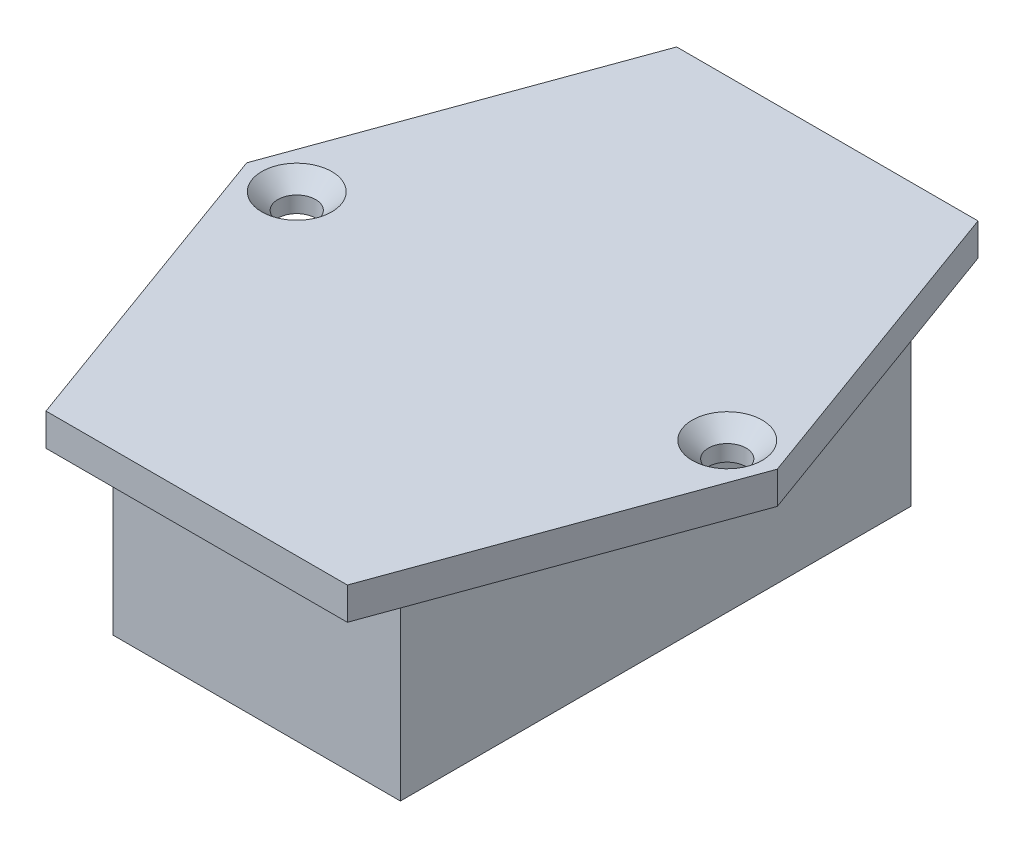
ISO-10303-21;
HEADER;
FILE_DESCRIPTION(('STEP AP214'),'2;1');
FILE_NAME('part.step','',(''),(''),'','','');
FILE_SCHEMA(('AUTOMOTIVE_DESIGN { 1 0 10303 214 1 1 1 1 }'));
ENDSEC;
DATA;
#1=APPLICATION_CONTEXT('core data for automotive mechanical design processes');
#2=APPLICATION_PROTOCOL_DEFINITION('international standard','automotive_design',2000,#1);
#3=PRODUCT_CONTEXT('',#1,'mechanical');
#4=PRODUCT('Part','Part','',(#3));
#5=PRODUCT_RELATED_PRODUCT_CATEGORY('part','',(#4));
#6=PRODUCT_DEFINITION_FORMATION('','',#4);
#7=PRODUCT_DEFINITION_CONTEXT('part definition',#1,'design');
#8=PRODUCT_DEFINITION('design','',#6,#7);
#9=PRODUCT_DEFINITION_SHAPE('','',#8);
#10=(LENGTH_UNIT() NAMED_UNIT(*) SI_UNIT(.MILLI.,.METRE.));
#11=(NAMED_UNIT(*) PLANE_ANGLE_UNIT() SI_UNIT($,.RADIAN.));
#12=(NAMED_UNIT(*) SI_UNIT($,.STERADIAN.) SOLID_ANGLE_UNIT());
#13=UNCERTAINTY_MEASURE_WITH_UNIT(LENGTH_MEASURE(1.E-05),#10,'distance_accuracy_value','');
#14=(GEOMETRIC_REPRESENTATION_CONTEXT(3) GLOBAL_UNCERTAINTY_ASSIGNED_CONTEXT((#13)) GLOBAL_UNIT_ASSIGNED_CONTEXT((#10,
#11,#12)) REPRESENTATION_CONTEXT('',''));
#15=CARTESIAN_POINT('',(0.,0.,0.));
#16=DIRECTION('',(0.,0.,1.));
#17=DIRECTION('',(1.,0.,0.));
#18=AXIS2_PLACEMENT_3D('',#15,#16,#17);
#19=CARTESIAN_POINT('',(-2.5,-27.5,-19.47));
#20=DIRECTION('',(1.,0.,0.));
#21=DIRECTION('',(0.,0.,-1.));
#22=AXIS2_PLACEMENT_3D('',#19,#20,#21);
#23=PLANE('',#22);
#24=DIRECTION('',(0.,0.,-1.));
#25=VECTOR('',#24,1.);
#26=CARTESIAN_POINT('',(-2.5,-17.5,-19.47));
#27=LINE('',#26,#25);
#28=CARTESIAN_POINT('',(-2.5,-17.5,-19.47));
#29=VERTEX_POINT('',#28);
#30=CARTESIAN_POINT('',(-2.5,-17.5,-20.22));
#31=VERTEX_POINT('',#30);
#32=EDGE_CURVE('E108',#29,#31,#27,.T.);
#33=ORIENTED_EDGE('',*,*,#32,.T.);
#34=DIRECTION('',(0.,1.,0.));
#35=VECTOR('',#34,1.);
#36=CARTESIAN_POINT('',(-2.5,-27.5,-20.22));
#37=LINE('',#36,#35);
#38=CARTESIAN_POINT('',(-2.5,-27.5,-20.22));
#39=VERTEX_POINT('',#38);
#40=EDGE_CURVE('E12',#39,#31,#37,.T.);
#41=ORIENTED_EDGE('',*,*,#40,.F.);
#42=DIRECTION('',(0.,0.,-1.));
#43=VECTOR('',#42,1.);
#44=CARTESIAN_POINT('',(-2.5,-27.5,-19.47));
#45=LINE('',#44,#43);
#46=CARTESIAN_POINT('',(-2.5,-27.5,-19.47));
#47=VERTEX_POINT('',#46);
#48=EDGE_CURVE('E96',#47,#39,#45,.T.);
#49=ORIENTED_EDGE('',*,*,#48,.F.);
#50=DIRECTION('',(0.,1.,0.));
#51=VECTOR('',#50,1.);
#52=CARTESIAN_POINT('',(-2.5,-27.5,-19.47));
#53=LINE('',#52,#51);
#54=EDGE_CURVE('E104',#47,#29,#53,.T.);
#55=ORIENTED_EDGE('',*,*,#54,.T.);
#56=EDGE_LOOP('',(#33,#41,#49,#55));
#57=FACE_BOUND('',#56,.T.);
#58=ADVANCED_FACE('F45',(#57),#23,.F.);
#59=CARTESIAN_POINT('',(2.5,-27.5,-20.22));
#60=DIRECTION('',(0.,0.,1.));
#61=DIRECTION('',(1.,0.,0.));
#62=AXIS2_PLACEMENT_3D('',#59,#60,#61);
#63=PLANE('',#62);
#64=DIRECTION('',(1.,0.,0.));
#65=VECTOR('',#64,1.);
#66=CARTESIAN_POINT('',(2.5,-17.5,-20.22));
#67=LINE('',#66,#65);
#68=CARTESIAN_POINT('',(2.5,-17.5,-20.22));
#69=VERTEX_POINT('',#68);
#70=EDGE_CURVE('E100',#31,#69,#67,.T.);
#71=ORIENTED_EDGE('',*,*,#70,.T.);
#72=DIRECTION('',(0.,1.,0.));
#73=VECTOR('',#72,1.);
#74=CARTESIAN_POINT('',(2.5,-27.5,-20.22));
#75=LINE('',#74,#73);
#76=CARTESIAN_POINT('',(2.5,-27.5,-20.22));
#77=VERTEX_POINT('',#76);
#78=EDGE_CURVE('E53',#77,#69,#75,.T.);
#79=ORIENTED_EDGE('',*,*,#78,.F.);
#80=DIRECTION('',(1.,0.,0.));
#81=VECTOR('',#80,1.);
#82=CARTESIAN_POINT('',(2.5,-27.5,-20.22));
#83=LINE('',#82,#81);
#84=EDGE_CURVE('E91',#39,#77,#83,.T.);
#85=ORIENTED_EDGE('',*,*,#84,.F.);
#86=ORIENTED_EDGE('',*,*,#40,.T.);
#87=EDGE_LOOP('',(#71,#79,#85,#86));
#88=FACE_BOUND('',#87,.T.);
#89=ADVANCED_FACE('F99',(#88),#63,.F.);
#90=CARTESIAN_POINT('',(2.5,-27.5,-19.47));
#91=DIRECTION('',(-1.,0.,0.));
#92=DIRECTION('',(0.,0.,1.));
#93=AXIS2_PLACEMENT_3D('',#90,#91,#92);
#94=PLANE('',#93);
#95=DIRECTION('',(0.,0.,1.));
#96=VECTOR('',#95,1.);
#97=CARTESIAN_POINT('',(2.5,-17.5,-19.47));
#98=LINE('',#97,#96);
#99=CARTESIAN_POINT('',(2.5,-17.5,-19.47));
#100=VERTEX_POINT('',#99);
#101=EDGE_CURVE('E78',#69,#100,#98,.T.);
#102=ORIENTED_EDGE('',*,*,#101,.T.);
#103=DIRECTION('',(0.,1.,0.));
#104=VECTOR('',#103,1.);
#105=CARTESIAN_POINT('',(2.5,-27.5,-19.47));
#106=LINE('',#105,#104);
#107=CARTESIAN_POINT('',(2.5,-27.5,-19.47));
#108=VERTEX_POINT('',#107);
#109=EDGE_CURVE('E101',#108,#100,#106,.T.);
#110=ORIENTED_EDGE('',*,*,#109,.F.);
#111=DIRECTION('',(0.,0.,1.));
#112=VECTOR('',#111,1.);
#113=CARTESIAN_POINT('',(2.5,-27.5,-19.47));
#114=LINE('',#113,#112);
#115=EDGE_CURVE('E94',#77,#108,#114,.T.);
#116=ORIENTED_EDGE('',*,*,#115,.F.);
#117=ORIENTED_EDGE('',*,*,#78,.T.);
#118=EDGE_LOOP('',(#102,#110,#116,#117));
#119=FACE_BOUND('',#118,.T.);
#120=ADVANCED_FACE('F102',(#119),#94,.F.);
#121=CARTESIAN_POINT('',(2.5,-27.5,-19.47));
#122=DIRECTION('',(0.,0.,-1.));
#123=DIRECTION('',(-1.,0.,0.));
#124=AXIS2_PLACEMENT_3D('',#121,#122,#123);
#125=PLANE('',#124);
#126=DIRECTION('',(-1.,0.,0.));
#127=VECTOR('',#126,1.);
#128=CARTESIAN_POINT('',(2.5,-17.5,-19.47));
#129=LINE('',#128,#127);
#130=EDGE_CURVE('E84',#100,#29,#129,.T.);
#131=ORIENTED_EDGE('',*,*,#130,.T.);
#132=ORIENTED_EDGE('',*,*,#54,.F.);
#133=DIRECTION('',(-1.,0.,0.));
#134=VECTOR('',#133,1.);
#135=CARTESIAN_POINT('',(2.5,-27.5,-19.47));
#136=LINE('',#135,#134);
#137=EDGE_CURVE('E61',#108,#47,#136,.T.);
#138=ORIENTED_EDGE('',*,*,#137,.F.);
#139=ORIENTED_EDGE('',*,*,#109,.T.);
#140=EDGE_LOOP('',(#131,#132,#138,#139));
#141=FACE_BOUND('',#140,.T.);
#142=ADVANCED_FACE('F115',(#141),#125,.F.);
#143=CARTESIAN_POINT('',(0.,-27.5,0.));
#144=DIRECTION('',(0.,1.,0.));
#145=DIRECTION('',(0.,0.,1.));
#146=AXIS2_PLACEMENT_3D('',#143,#144,#145);
#147=PLANE('',#146);
#148=ORIENTED_EDGE('',*,*,#48,.T.);
#149=ORIENTED_EDGE('',*,*,#84,.T.);
#150=ORIENTED_EDGE('',*,*,#115,.T.);
#151=ORIENTED_EDGE('',*,*,#137,.T.);
#152=EDGE_LOOP('',(#148,#149,#150,#151));
#153=FACE_BOUND('',#152,.T.);
#154=ADVANCED_FACE('F92',(#153),#147,.F.);
#155=CARTESIAN_POINT('',(0.,-17.5,0.));
#156=DIRECTION('',(0.,1.,0.));
#157=DIRECTION('',(0.,0.,1.));
#158=AXIS2_PLACEMENT_3D('',#155,#156,#157);
#159=PLANE('',#158);
#160=ORIENTED_EDGE('',*,*,#32,.F.);
#161=ORIENTED_EDGE('',*,*,#130,.F.);
#162=ORIENTED_EDGE('',*,*,#101,.F.);
#163=ORIENTED_EDGE('',*,*,#70,.F.);
#164=EDGE_LOOP('',(#160,#161,#162,#163));
#165=FACE_BOUND('',#164,.T.);
#166=ADVANCED_FACE('F118',(#165),#159,.T.);
#167=CLOSED_SHELL('',(#58,#89,#120,#142,#154,#166));
#168=MANIFOLD_SOLID_BREP('B2',#167);
#169=CARTESIAN_POINT('',(0.,0.,0.));
#170=DIRECTION('',(0.,1.,0.));
#171=DIRECTION('',(0.,0.,1.));
#172=AXIS2_PLACEMENT_3D('',#169,#170,#171);
#173=PLANE('',#172);
#174=CARTESIAN_POINT('',(20.,0.,0.));
#175=DIRECTION('',(0.,1.,0.));
#176=DIRECTION('',(0.,0.,1.));
#177=AXIS2_PLACEMENT_3D('',#174,#175,#176);
#178=CIRCLE('',#177,1.75);
#179=CARTESIAN_POINT('',(20.,0.,1.75));
#180=VERTEX_POINT('',#179);
#181=EDGE_CURVE('E341',#180,#180,#178,.F.);
#182=ORIENTED_EDGE('',*,*,#181,.F.);
#183=EDGE_LOOP('',(#182));
#184=FACE_BOUND('',#183,.T.);
#185=CARTESIAN_POINT('',(-20.,0.,0.));
#186=DIRECTION('',(0.,1.,0.));
#187=DIRECTION('',(0.,0.,1.));
#188=AXIS2_PLACEMENT_3D('',#185,#186,#187);
#189=CIRCLE('',#188,1.75);
#190=CARTESIAN_POINT('',(-20.,0.,1.75000000000001));
#191=VERTEX_POINT('',#190);
#192=EDGE_CURVE('E339',#191,#191,#189,.F.);
#193=ORIENTED_EDGE('',*,*,#192,.F.);
#194=EDGE_LOOP('',(#193));
#195=FACE_BOUND('',#194,.T.);
#196=DIRECTION('',(0.341614285773997,0.,0.939840241612968));
#197=VECTOR('',#196,1.);
#198=CARTESIAN_POINT('',(-14.,0.,29.3));
#199=LINE('',#198,#197);
#200=CARTESIAN_POINT('',(-24.65,0.,0.));
#201=VERTEX_POINT('',#200);
#202=CARTESIAN_POINT('',(-14.,0.,29.3));
#203=VERTEX_POINT('',#202);
#204=EDGE_CURVE('E267',#201,#203,#199,.T.);
#205=ORIENTED_EDGE('',*,*,#204,.F.);
#206=DIRECTION('',(-0.341614285773997,0.,0.939840241612968));
#207=VECTOR('',#206,1.);
#208=CARTESIAN_POINT('',(-14.,0.,-29.3));
#209=LINE('',#208,#207);
#210=CARTESIAN_POINT('',(-14.,0.,-29.3));
#211=VERTEX_POINT('',#210);
#212=EDGE_CURVE('E280',#211,#201,#209,.T.);
#213=ORIENTED_EDGE('',*,*,#212,.F.);
#214=DIRECTION('',(-1.,0.,0.));
#215=VECTOR('',#214,1.);
#216=CARTESIAN_POINT('',(14.,0.,-29.3));
#217=LINE('',#216,#215);
#218=CARTESIAN_POINT('',(14.,0.,-29.3));
#219=VERTEX_POINT('',#218);
#220=EDGE_CURVE('E296',#219,#211,#217,.T.);
#221=ORIENTED_EDGE('',*,*,#220,.F.);
#222=DIRECTION('',(-0.341614285773997,0.,-0.939840241612968));
#223=VECTOR('',#222,1.);
#224=CARTESIAN_POINT('',(14.,0.,-29.3));
#225=LINE('',#224,#223);
#226=CARTESIAN_POINT('',(24.65,0.,0.));
#227=VERTEX_POINT('',#226);
#228=EDGE_CURVE('E294',#227,#219,#225,.T.);
#229=ORIENTED_EDGE('',*,*,#228,.F.);
#230=DIRECTION('',(0.341614285773997,0.,-0.939840241612968));
#231=VECTOR('',#230,1.);
#232=CARTESIAN_POINT('',(14.,0.,29.3));
#233=LINE('',#232,#231);
#234=CARTESIAN_POINT('',(14.,0.,29.3));
#235=VERTEX_POINT('',#234);
#236=EDGE_CURVE('E292',#235,#227,#233,.T.);
#237=ORIENTED_EDGE('',*,*,#236,.F.);
#238=DIRECTION('',(1.,0.,0.));
#239=VECTOR('',#238,1.);
#240=CARTESIAN_POINT('',(14.,0.,29.3));
#241=LINE('',#240,#239);
#242=EDGE_CURVE('E270',#203,#235,#241,.T.);
#243=ORIENTED_EDGE('',*,*,#242,.F.);
#244=EDGE_LOOP('',(#205,#213,#221,#229,#237,#243));
#245=FACE_BOUND('',#244,.T.);
#246=DIRECTION('',(0.,0.,-1.));
#247=VECTOR('',#246,1.);
#248=CARTESIAN_POINT('',(-13.35,0.,23.72));
#249=LINE('',#248,#247);
#250=CARTESIAN_POINT('',(-13.35,0.,23.72));
#251=VERTEX_POINT('',#250);
#252=CARTESIAN_POINT('',(-13.35,0.,-23.72));
#253=VERTEX_POINT('',#252);
#254=EDGE_CURVE('E185',#251,#253,#249,.T.);
#255=ORIENTED_EDGE('',*,*,#254,.F.);
#256=DIRECTION('',(-1.,0.,0.));
#257=VECTOR('',#256,1.);
#258=CARTESIAN_POINT('',(13.35,0.,23.72));
#259=LINE('',#258,#257);
#260=CARTESIAN_POINT('',(13.35,0.,23.72));
#261=VERTEX_POINT('',#260);
#262=EDGE_CURVE('E189',#261,#251,#259,.T.);
#263=ORIENTED_EDGE('',*,*,#262,.F.);
#264=DIRECTION('',(0.,0.,1.));
#265=VECTOR('',#264,1.);
#266=CARTESIAN_POINT('',(13.35,0.,23.72));
#267=LINE('',#266,#265);
#268=CARTESIAN_POINT('',(13.35,0.,-23.72));
#269=VERTEX_POINT('',#268);
#270=EDGE_CURVE('E352',#269,#261,#267,.T.);
#271=ORIENTED_EDGE('',*,*,#270,.F.);
#272=DIRECTION('',(1.,0.,0.));
#273=VECTOR('',#272,1.);
#274=CARTESIAN_POINT('',(13.35,0.,-23.72));
#275=LINE('',#274,#273);
#276=EDGE_CURVE('E350',#253,#269,#275,.T.);
#277=ORIENTED_EDGE('',*,*,#276,.F.);
#278=EDGE_LOOP('',(#255,#263,#271,#277));
#279=FACE_BOUND('',#278,.T.);
#280=ADVANCED_FACE('F169',(#184,#195,#245,#279),#173,.F.);
#281=CARTESIAN_POINT('',(-14.,3.,29.3));
#282=DIRECTION('',(0.939840241612968,0.,-0.341614285773997));
#283=DIRECTION('',(-0.341614285773997,0.,-0.939840241612968));
#284=AXIS2_PLACEMENT_3D('',#281,#282,#283);
#285=PLANE('',#284);
#286=ORIENTED_EDGE('',*,*,#204,.T.);
#287=DIRECTION('',(0.,-1.,0.));
#288=VECTOR('',#287,1.);
#289=CARTESIAN_POINT('',(-14.,3.,29.3));
#290=LINE('',#289,#288);
#291=CARTESIAN_POINT('',(-14.,3.,29.3));
#292=VERTEX_POINT('',#291);
#293=EDGE_CURVE('E313',#292,#203,#290,.T.);
#294=ORIENTED_EDGE('',*,*,#293,.F.);
#295=DIRECTION('',(0.341614285773997,0.,0.939840241612968));
#296=VECTOR('',#295,1.);
#297=CARTESIAN_POINT('',(-14.,3.,29.3));
#298=LINE('',#297,#296);
#299=CARTESIAN_POINT('',(-24.65,3.,0.));
#300=VERTEX_POINT('',#299);
#301=EDGE_CURVE('E276',#300,#292,#298,.T.);
#302=ORIENTED_EDGE('',*,*,#301,.F.);
#303=DIRECTION('',(0.,-1.,0.));
#304=VECTOR('',#303,1.);
#305=CARTESIAN_POINT('',(-24.65,3.,0.));
#306=LINE('',#305,#304);
#307=EDGE_CURVE('E289',#300,#201,#306,.T.);
#308=ORIENTED_EDGE('',*,*,#307,.T.);
#309=EDGE_LOOP('',(#286,#294,#302,#308));
#310=FACE_BOUND('',#309,.T.);
#311=ADVANCED_FACE('F362',(#310),#285,.F.);
#312=CARTESIAN_POINT('',(14.,3.,29.3));
#313=DIRECTION('',(0.,0.,-1.));
#314=DIRECTION('',(-1.,0.,0.));
#315=AXIS2_PLACEMENT_3D('',#312,#313,#314);
#316=PLANE('',#315);
#317=ORIENTED_EDGE('',*,*,#242,.T.);
#318=DIRECTION('',(0.,-1.,0.));
#319=VECTOR('',#318,1.);
#320=CARTESIAN_POINT('',(14.,3.,29.3));
#321=LINE('',#320,#319);
#322=CARTESIAN_POINT('',(14.,3.,29.3));
#323=VERTEX_POINT('',#322);
#324=EDGE_CURVE('E310',#323,#235,#321,.T.);
#325=ORIENTED_EDGE('',*,*,#324,.F.);
#326=DIRECTION('',(1.,0.,0.));
#327=VECTOR('',#326,1.);
#328=CARTESIAN_POINT('',(14.,3.,29.3));
#329=LINE('',#328,#327);
#330=EDGE_CURVE('E279',#292,#323,#329,.T.);
#331=ORIENTED_EDGE('',*,*,#330,.F.);
#332=ORIENTED_EDGE('',*,*,#293,.T.);
#333=EDGE_LOOP('',(#317,#325,#331,#332));
#334=FACE_BOUND('',#333,.T.);
#335=ADVANCED_FACE('F368',(#334),#316,.F.);
#336=CARTESIAN_POINT('',(14.,3.,29.3));
#337=DIRECTION('',(-0.939840241612968,0.,-0.341614285773997));
#338=DIRECTION('',(-0.341614285773997,0.,0.939840241612968));
#339=AXIS2_PLACEMENT_3D('',#336,#337,#338);
#340=PLANE('',#339);
#341=ORIENTED_EDGE('',*,*,#236,.T.);
#342=DIRECTION('',(0.,-1.,0.));
#343=VECTOR('',#342,1.);
#344=CARTESIAN_POINT('',(24.65,3.,0.));
#345=LINE('',#344,#343);
#346=CARTESIAN_POINT('',(24.65,3.,0.));
#347=VERTEX_POINT('',#346);
#348=EDGE_CURVE('E307',#347,#227,#345,.T.);
#349=ORIENTED_EDGE('',*,*,#348,.F.);
#350=DIRECTION('',(0.341614285773997,0.,-0.939840241612968));
#351=VECTOR('',#350,1.);
#352=CARTESIAN_POINT('',(14.,3.,29.3));
#353=LINE('',#352,#351);
#354=EDGE_CURVE('E282',#323,#347,#353,.T.);
#355=ORIENTED_EDGE('',*,*,#354,.F.);
#356=ORIENTED_EDGE('',*,*,#324,.T.);
#357=EDGE_LOOP('',(#341,#349,#355,#356));
#358=FACE_BOUND('',#357,.T.);
#359=ADVANCED_FACE('F386',(#358),#340,.F.);
#360=CARTESIAN_POINT('',(14.,3.,-29.3));
#361=DIRECTION('',(-0.939840241612968,0.,0.341614285773997));
#362=DIRECTION('',(0.341614285773997,0.,0.939840241612968));
#363=AXIS2_PLACEMENT_3D('',#360,#361,#362);
#364=PLANE('',#363);
#365=ORIENTED_EDGE('',*,*,#228,.T.);
#366=DIRECTION('',(0.,-1.,0.));
#367=VECTOR('',#366,1.);
#368=CARTESIAN_POINT('',(14.,3.,-29.3));
#369=LINE('',#368,#367);
#370=CARTESIAN_POINT('',(14.,3.,-29.3));
#371=VERTEX_POINT('',#370);
#372=EDGE_CURVE('E304',#371,#219,#369,.T.);
#373=ORIENTED_EDGE('',*,*,#372,.F.);
#374=DIRECTION('',(-0.341614285773997,0.,-0.939840241612968));
#375=VECTOR('',#374,1.);
#376=CARTESIAN_POINT('',(14.,3.,-29.3));
#377=LINE('',#376,#375);
#378=EDGE_CURVE('E284',#347,#371,#377,.T.);
#379=ORIENTED_EDGE('',*,*,#378,.F.);
#380=ORIENTED_EDGE('',*,*,#348,.T.);
#381=EDGE_LOOP('',(#365,#373,#379,#380));
#382=FACE_BOUND('',#381,.T.);
#383=ADVANCED_FACE('F382',(#382),#364,.F.);
#384=CARTESIAN_POINT('',(14.,3.,-29.3));
#385=DIRECTION('',(0.,0.,1.));
#386=DIRECTION('',(1.,0.,0.));
#387=AXIS2_PLACEMENT_3D('',#384,#385,#386);
#388=PLANE('',#387);
#389=ORIENTED_EDGE('',*,*,#220,.T.);
#390=DIRECTION('',(0.,-1.,0.));
#391=VECTOR('',#390,1.);
#392=CARTESIAN_POINT('',(-14.,3.,-29.3));
#393=LINE('',#392,#391);
#394=CARTESIAN_POINT('',(-14.,3.,-29.3));
#395=VERTEX_POINT('',#394);
#396=EDGE_CURVE('E301',#395,#211,#393,.T.);
#397=ORIENTED_EDGE('',*,*,#396,.F.);
#398=DIRECTION('',(-1.,0.,0.));
#399=VECTOR('',#398,1.);
#400=CARTESIAN_POINT('',(14.,3.,-29.3));
#401=LINE('',#400,#399);
#402=EDGE_CURVE('E286',#371,#395,#401,.T.);
#403=ORIENTED_EDGE('',*,*,#402,.F.);
#404=ORIENTED_EDGE('',*,*,#372,.T.);
#405=EDGE_LOOP('',(#389,#397,#403,#404));
#406=FACE_BOUND('',#405,.T.);
#407=ADVANCED_FACE('F378',(#406),#388,.F.);
#408=CARTESIAN_POINT('',(-14.,3.,-29.3));
#409=DIRECTION('',(0.939840241612968,0.,0.341614285773997));
#410=DIRECTION('',(0.341614285773997,0.,-0.939840241612968));
#411=AXIS2_PLACEMENT_3D('',#408,#409,#410);
#412=PLANE('',#411);
#413=ORIENTED_EDGE('',*,*,#212,.T.);
#414=ORIENTED_EDGE('',*,*,#307,.F.);
#415=DIRECTION('',(-0.341614285773997,0.,0.939840241612968));
#416=VECTOR('',#415,1.);
#417=CARTESIAN_POINT('',(-14.,3.,-29.3));
#418=LINE('',#417,#416);
#419=EDGE_CURVE('E288',#395,#300,#418,.T.);
#420=ORIENTED_EDGE('',*,*,#419,.F.);
#421=ORIENTED_EDGE('',*,*,#396,.T.);
#422=EDGE_LOOP('',(#413,#414,#420,#421));
#423=FACE_BOUND('',#422,.T.);
#424=ADVANCED_FACE('F375',(#423),#412,.F.);
#425=CARTESIAN_POINT('',(0.,3.,0.));
#426=DIRECTION('',(0.,1.,0.));
#427=DIRECTION('',(0.,0.,1.));
#428=AXIS2_PLACEMENT_3D('',#425,#426,#427);
#429=PLANE('',#428);
#430=CARTESIAN_POINT('',(-20.,3.,0.));
#431=DIRECTION('',(0.,1.,0.));
#432=DIRECTION('',(0.,0.,1.));
#433=AXIS2_PLACEMENT_3D('',#430,#431,#432);
#434=CIRCLE('',#433,3.25000000000001);
#435=CARTESIAN_POINT('',(-20.,3.,3.25000000000002));
#436=VERTEX_POINT('',#435);
#437=EDGE_CURVE('E178',#436,#436,#434,.F.);
#438=ORIENTED_EDGE('',*,*,#437,.T.);
#439=EDGE_LOOP('',(#438));
#440=FACE_BOUND('',#439,.T.);
#441=CARTESIAN_POINT('',(20.,3.,0.));
#442=DIRECTION('',(0.,1.,0.));
#443=DIRECTION('',(0.,0.,1.));
#444=AXIS2_PLACEMENT_3D('',#441,#442,#443);
#445=CIRCLE('',#444,3.25000000000001);
#446=CARTESIAN_POINT('',(20.,3.,3.25000000000001));
#447=VERTEX_POINT('',#446);
#448=EDGE_CURVE('E319',#447,#447,#445,.F.);
#449=ORIENTED_EDGE('',*,*,#448,.T.);
#450=EDGE_LOOP('',(#449));
#451=FACE_BOUND('',#450,.T.);
#452=ORIENTED_EDGE('',*,*,#301,.T.);
#453=ORIENTED_EDGE('',*,*,#330,.T.);
#454=ORIENTED_EDGE('',*,*,#354,.T.);
#455=ORIENTED_EDGE('',*,*,#378,.T.);
#456=ORIENTED_EDGE('',*,*,#402,.T.);
#457=ORIENTED_EDGE('',*,*,#419,.T.);
#458=EDGE_LOOP('',(#452,#453,#454,#455,#456,#457));
#459=FACE_BOUND('',#458,.T.);
#460=ADVANCED_FACE('F324',(#440,#451,#459),#429,.T.);
#461=CARTESIAN_POINT('',(-13.35,-17.5,23.72));
#462=DIRECTION('',(1.,0.,0.));
#463=DIRECTION('',(0.,0.,-1.));
#464=AXIS2_PLACEMENT_3D('',#461,#462,#463);
#465=PLANE('',#464);
#466=ORIENTED_EDGE('',*,*,#254,.T.);
#467=DIRECTION('',(0.,1.,0.));
#468=VECTOR('',#467,1.);
#469=CARTESIAN_POINT('',(-13.35,-17.5,-23.72));
#470=LINE('',#469,#468);
#471=CARTESIAN_POINT('',(-13.35,-17.5,-23.72));
#472=VERTEX_POINT('',#471);
#473=EDGE_CURVE('E250',#472,#253,#470,.T.);
#474=ORIENTED_EDGE('',*,*,#473,.F.);
#475=DIRECTION('',(0.,0.,-1.));
#476=VECTOR('',#475,1.);
#477=CARTESIAN_POINT('',(-13.35,-17.5,23.72));
#478=LINE('',#477,#476);
#479=CARTESIAN_POINT('',(-13.35,-17.5,23.72));
#480=VERTEX_POINT('',#479);
#481=EDGE_CURVE('E256',#480,#472,#478,.T.);
#482=ORIENTED_EDGE('',*,*,#481,.F.);
#483=DIRECTION('',(0.,1.,0.));
#484=VECTOR('',#483,1.);
#485=CARTESIAN_POINT('',(-13.35,-17.5,23.72));
#486=LINE('',#485,#484);
#487=EDGE_CURVE('E348',#480,#251,#486,.T.);
#488=ORIENTED_EDGE('',*,*,#487,.T.);
#489=EDGE_LOOP('',(#466,#474,#482,#488));
#490=FACE_BOUND('',#489,.T.);
#491=ADVANCED_FACE('F266',(#490),#465,.F.);
#492=CARTESIAN_POINT('',(13.35,-17.5,-23.72));
#493=DIRECTION('',(0.,0.,1.));
#494=DIRECTION('',(1.,0.,0.));
#495=AXIS2_PLACEMENT_3D('',#492,#493,#494);
#496=PLANE('',#495);
#497=ORIENTED_EDGE('',*,*,#276,.T.);
#498=DIRECTION('',(0.,1.,0.));
#499=VECTOR('',#498,1.);
#500=CARTESIAN_POINT('',(13.35,-17.5,-23.72));
#501=LINE('',#500,#499);
#502=CARTESIAN_POINT('',(13.35,-17.5,-23.72));
#503=VERTEX_POINT('',#502);
#504=EDGE_CURVE('E252',#503,#269,#501,.T.);
#505=ORIENTED_EDGE('',*,*,#504,.F.);
#506=DIRECTION('',(1.,0.,0.));
#507=VECTOR('',#506,1.);
#508=CARTESIAN_POINT('',(13.35,-17.5,-23.72));
#509=LINE('',#508,#507);
#510=EDGE_CURVE('E245',#472,#503,#509,.T.);
#511=ORIENTED_EDGE('',*,*,#510,.F.);
#512=ORIENTED_EDGE('',*,*,#473,.T.);
#513=EDGE_LOOP('',(#497,#505,#511,#512));
#514=FACE_BOUND('',#513,.T.);
#515=ADVANCED_FACE('F248',(#514),#496,.F.);
#516=CARTESIAN_POINT('',(13.35,-17.5,23.72));
#517=DIRECTION('',(-1.,0.,0.));
#518=DIRECTION('',(0.,0.,1.));
#519=AXIS2_PLACEMENT_3D('',#516,#517,#518);
#520=PLANE('',#519);
#521=ORIENTED_EDGE('',*,*,#270,.T.);
#522=DIRECTION('',(0.,1.,0.));
#523=VECTOR('',#522,1.);
#524=CARTESIAN_POINT('',(13.35,-17.5,23.72));
#525=LINE('',#524,#523);
#526=CARTESIAN_POINT('',(13.35,-17.5,23.72));
#527=VERTEX_POINT('',#526);
#528=EDGE_CURVE('E272',#527,#261,#525,.T.);
#529=ORIENTED_EDGE('',*,*,#528,.F.);
#530=DIRECTION('',(0.,0.,1.));
#531=VECTOR('',#530,1.);
#532=CARTESIAN_POINT('',(13.35,-17.5,23.72));
#533=LINE('',#532,#531);
#534=EDGE_CURVE('E255',#503,#527,#533,.T.);
#535=ORIENTED_EDGE('',*,*,#534,.F.);
#536=ORIENTED_EDGE('',*,*,#504,.T.);
#537=EDGE_LOOP('',(#521,#529,#535,#536));
#538=FACE_BOUND('',#537,.T.);
#539=ADVANCED_FACE('F360',(#538),#520,.F.);
#540=CARTESIAN_POINT('',(13.35,-17.5,23.72));
#541=DIRECTION('',(0.,0.,-1.));
#542=DIRECTION('',(-1.,0.,0.));
#543=AXIS2_PLACEMENT_3D('',#540,#541,#542);
#544=PLANE('',#543);
#545=ORIENTED_EDGE('',*,*,#262,.T.);
#546=ORIENTED_EDGE('',*,*,#487,.F.);
#547=DIRECTION('',(-1.,0.,0.));
#548=VECTOR('',#547,1.);
#549=CARTESIAN_POINT('',(13.35,-17.5,23.72));
#550=LINE('',#549,#548);
#551=EDGE_CURVE('E261',#527,#480,#550,.T.);
#552=ORIENTED_EDGE('',*,*,#551,.F.);
#553=ORIENTED_EDGE('',*,*,#528,.T.);
#554=EDGE_LOOP('',(#545,#546,#552,#553));
#555=FACE_BOUND('',#554,.T.);
#556=ADVANCED_FACE('F358',(#555),#544,.F.);
#557=CARTESIAN_POINT('',(0.,-17.5,0.));
#558=DIRECTION('',(0.,1.,0.));
#559=DIRECTION('',(0.,0.,1.));
#560=AXIS2_PLACEMENT_3D('',#557,#558,#559);
#561=PLANE('',#560);
#562=ORIENTED_EDGE('',*,*,#481,.T.);
#563=ORIENTED_EDGE('',*,*,#510,.T.);
#564=ORIENTED_EDGE('',*,*,#534,.T.);
#565=ORIENTED_EDGE('',*,*,#551,.T.);
#566=EDGE_LOOP('',(#562,#563,#564,#565));
#567=FACE_BOUND('',#566,.T.);
#568=ADVANCED_FACE('F259',(#567),#561,.F.);
#569=CARTESIAN_POINT('',(-20.,-27.501,0.));
#570=DIRECTION('',(0.,1.,0.));
#571=DIRECTION('',(0.,0.,1.));
#572=AXIS2_PLACEMENT_3D('',#569,#570,#571);
#573=CYLINDRICAL_SURFACE('',#572,1.75);
#574=CARTESIAN_POINT('',(-20.,1.49999999999999,0.));
#575=DIRECTION('',(0.,1.,0.));
#576=DIRECTION('',(0.,0.,1.));
#577=AXIS2_PLACEMENT_3D('',#574,#575,#576);
#578=CIRCLE('',#577,1.75);
#579=CARTESIAN_POINT('',(-20.,1.49999999999999,1.75000000000001));
#580=VERTEX_POINT('',#579);
#581=EDGE_CURVE('E316',#580,#580,#578,.T.);
#582=ORIENTED_EDGE('',*,*,#581,.T.);
#583=EDGE_LOOP('',(#582));
#584=FACE_BOUND('',#583,.T.);
#585=ORIENTED_EDGE('',*,*,#192,.T.);
#586=EDGE_LOOP('',(#585));
#587=FACE_BOUND('',#586,.T.);
#588=ADVANCED_FACE('F333',(#584,#587),#573,.F.);
#589=CARTESIAN_POINT('',(20.,-27.501,0.));
#590=DIRECTION('',(0.,1.,0.));
#591=DIRECTION('',(0.,0.,1.));
#592=AXIS2_PLACEMENT_3D('',#589,#590,#591);
#593=CYLINDRICAL_SURFACE('',#592,1.75);
#594=CARTESIAN_POINT('',(20.,1.49999999999999,0.));
#595=DIRECTION('',(0.,1.,0.));
#596=DIRECTION('',(0.,0.,1.));
#597=AXIS2_PLACEMENT_3D('',#594,#595,#596);
#598=CIRCLE('',#597,1.75);
#599=CARTESIAN_POINT('',(20.,1.49999999999999,1.75));
#600=VERTEX_POINT('',#599);
#601=EDGE_CURVE('E43',#600,#600,#598,.T.);
#602=ORIENTED_EDGE('',*,*,#601,.T.);
#603=EDGE_LOOP('',(#602));
#604=FACE_BOUND('',#603,.T.);
#605=ORIENTED_EDGE('',*,*,#181,.T.);
#606=EDGE_LOOP('',(#605));
#607=FACE_BOUND('',#606,.T.);
#608=ADVANCED_FACE('F330',(#604,#607),#593,.F.);
#609=CARTESIAN_POINT('',(-20.,1.49999999999999,0.));
#610=DIRECTION('',(0.,1.,0.));
#611=DIRECTION('',(0.,0.,1.));
#612=AXIS2_PLACEMENT_3D('',#609,#610,#611);
#613=CONICAL_SURFACE('',#612,1.75,0.785398163397449);
#614=ORIENTED_EDGE('',*,*,#437,.F.);
#615=EDGE_LOOP('',(#614));
#616=FACE_BOUND('',#615,.T.);
#617=ORIENTED_EDGE('',*,*,#581,.F.);
#618=EDGE_LOOP('',(#617));
#619=FACE_BOUND('',#618,.T.);
#620=ADVANCED_FACE('F327',(#616,#619),#613,.F.);
#621=CARTESIAN_POINT('',(20.,1.49999999999999,0.));
#622=DIRECTION('',(0.,1.,0.));
#623=DIRECTION('',(0.,0.,1.));
#624=AXIS2_PLACEMENT_3D('',#621,#622,#623);
#625=CONICAL_SURFACE('',#624,1.75,0.785398163397449);
#626=ORIENTED_EDGE('',*,*,#448,.F.);
#627=EDGE_LOOP('',(#626));
#628=FACE_BOUND('',#627,.T.);
#629=ORIENTED_EDGE('',*,*,#601,.F.);
#630=EDGE_LOOP('',(#629));
#631=FACE_BOUND('',#630,.T.);
#632=ADVANCED_FACE('F172',(#628,#631),#625,.F.);
#633=CLOSED_SHELL('',(#280,#311,#335,#359,#383,#407,#424,#460,#491,#515,#539,#556,#568,#588,
#608,#620,#632));
#634=MANIFOLD_SOLID_BREP('B6',#633);
#635=ADVANCED_BREP_SHAPE_REPRESENTATION('',(#18,#168,#634),#14);
#636=SHAPE_DEFINITION_REPRESENTATION(#9,#635);
ENDSEC;
END-ISO-10303-21;
